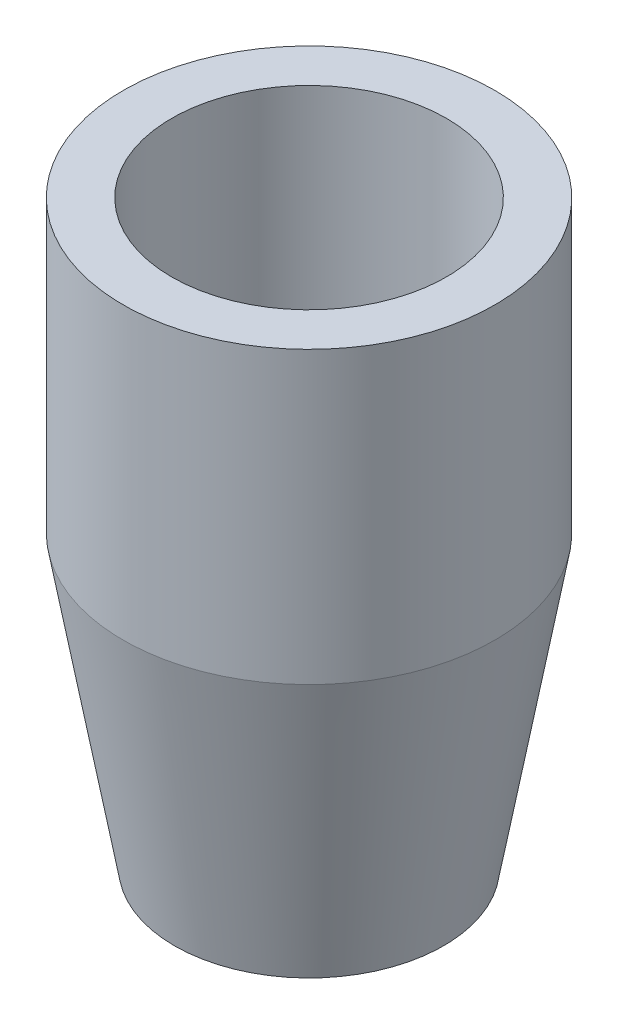
ISO-10303-21;
HEADER;
FILE_DESCRIPTION(('STEP AP214'),'2;1');
FILE_NAME('part.step','',(''),(''),'','','');
FILE_SCHEMA(('AUTOMOTIVE_DESIGN { 1 0 10303 214 1 1 1 1 }'));
ENDSEC;
DATA;
#1=APPLICATION_CONTEXT('core data for automotive mechanical design processes');
#2=APPLICATION_PROTOCOL_DEFINITION('international standard','automotive_design',2000,#1);
#3=PRODUCT_CONTEXT('',#1,'mechanical');
#4=PRODUCT('Part','Part','',(#3));
#5=PRODUCT_RELATED_PRODUCT_CATEGORY('part','',(#4));
#6=PRODUCT_DEFINITION_FORMATION('','',#4);
#7=PRODUCT_DEFINITION_CONTEXT('part definition',#1,'design');
#8=PRODUCT_DEFINITION('design','',#6,#7);
#9=PRODUCT_DEFINITION_SHAPE('','',#8);
#10=(LENGTH_UNIT() NAMED_UNIT(*) SI_UNIT(.MILLI.,.METRE.));
#11=(NAMED_UNIT(*) PLANE_ANGLE_UNIT() SI_UNIT($,.RADIAN.));
#12=(NAMED_UNIT(*) SI_UNIT($,.STERADIAN.) SOLID_ANGLE_UNIT());
#13=UNCERTAINTY_MEASURE_WITH_UNIT(LENGTH_MEASURE(1.E-05),#10,'distance_accuracy_value','');
#14=(GEOMETRIC_REPRESENTATION_CONTEXT(3) GLOBAL_UNCERTAINTY_ASSIGNED_CONTEXT((#13)) GLOBAL_UNIT_ASSIGNED_CONTEXT((#10,
#11,#12)) REPRESENTATION_CONTEXT('',''));
#15=CARTESIAN_POINT('',(0.,0.,0.));
#16=DIRECTION('',(0.,0.,1.));
#17=DIRECTION('',(1.,0.,0.));
#18=AXIS2_PLACEMENT_3D('',#15,#16,#17);
#19=CARTESIAN_POINT('',(-16.2818840700152,0.,0.));
#20=DIRECTION('',(0.,-1.,0.));
#21=DIRECTION('',(0.,0.,-1.));
#22=AXIS2_PLACEMENT_3D('',#19,#20,#21);
#23=CYLINDRICAL_SURFACE('',#22,16.2818840700152);
#24=CARTESIAN_POINT('',(-16.2818840700152,0.,0.));
#25=DIRECTION('',(0.,-1.,0.));
#26=DIRECTION('',(0.,0.,-1.));
#27=AXIS2_PLACEMENT_3D('',#24,#25,#26);
#28=CIRCLE('',#27,16.2818840700152);
#29=CARTESIAN_POINT('',(-16.2818840700152,0.,-16.2818840700152));
#30=VERTEX_POINT('',#29);
#31=EDGE_CURVE('E10',#30,#30,#28,.T.);
#32=ORIENTED_EDGE('',*,*,#31,.T.);
#33=EDGE_LOOP('',(#32));
#34=FACE_BOUND('',#33,.T.);
#35=CARTESIAN_POINT('',(-16.2818840700152,50.8,0.));
#36=DIRECTION('',(0.,-1.,0.));
#37=DIRECTION('',(0.,0.,-1.));
#38=AXIS2_PLACEMENT_3D('',#35,#36,#37);
#39=CIRCLE('',#38,16.2818840700152);
#40=CARTESIAN_POINT('',(-16.2818840700152,50.8,-16.2818840700152));
#41=VERTEX_POINT('',#40);
#42=EDGE_CURVE('E63',#41,#41,#39,.T.);
#43=ORIENTED_EDGE('',*,*,#42,.F.);
#44=EDGE_LOOP('',(#43));
#45=FACE_BOUND('',#44,.T.);
#46=ADVANCED_FACE('F35',(#34,#45),#23,.F.);
#47=CARTESIAN_POINT('',(0.,0.,0.));
#48=DIRECTION('',(0.,-1.,0.));
#49=DIRECTION('',(0.,0.,-1.));
#50=AXIS2_PLACEMENT_3D('',#47,#48,#49);
#51=PLANE('',#50);
#52=CARTESIAN_POINT('',(-16.2818840700152,0.,0.));
#53=DIRECTION('',(0.,-1.,0.));
#54=DIRECTION('',(0.,0.,-1.));
#55=AXIS2_PLACEMENT_3D('',#52,#53,#54);
#56=CIRCLE('',#55,35.3318840700152);
#57=CARTESIAN_POINT('',(-16.2818840700152,0.,-35.3318840700152));
#58=VERTEX_POINT('',#57);
#59=EDGE_CURVE('E41',#58,#58,#56,.T.);
#60=ORIENTED_EDGE('',*,*,#59,.T.);
#61=EDGE_LOOP('',(#60));
#62=FACE_BOUND('',#61,.T.);
#63=ORIENTED_EDGE('',*,*,#31,.F.);
#64=EDGE_LOOP('',(#63));
#65=FACE_BOUND('',#64,.T.);
#66=ADVANCED_FACE('F71',(#62,#65),#51,.T.);
#67=CARTESIAN_POINT('',(-16.2818840700152,0.,0.));
#68=DIRECTION('',(0.,1.,0.));
#69=DIRECTION('',(0.,0.,1.));
#70=AXIS2_PLACEMENT_3D('',#67,#68,#69);
#71=CONICAL_SURFACE('',#70,35.3318840700152,0.17453292519943);
#72=CARTESIAN_POINT('',(-16.2818840700152,76.2,0.));
#73=DIRECTION('',(0.,-1.,0.));
#74=DIRECTION('',(0.,0.,-1.));
#75=AXIS2_PLACEMENT_3D('',#72,#73,#74);
#76=CIRCLE('',#75,48.768);
#77=CARTESIAN_POINT('',(-16.2818840700152,76.2,-48.768));
#78=VERTEX_POINT('',#77);
#79=EDGE_CURVE('E45',#78,#78,#76,.T.);
#80=ORIENTED_EDGE('',*,*,#79,.T.);
#81=EDGE_LOOP('',(#80));
#82=FACE_BOUND('',#81,.T.);
#83=ORIENTED_EDGE('',*,*,#59,.F.);
#84=EDGE_LOOP('',(#83));
#85=FACE_BOUND('',#84,.T.);
#86=ADVANCED_FACE('F75',(#82,#85),#71,.T.);
#87=CARTESIAN_POINT('',(-16.2818840700152,0.,0.));
#88=DIRECTION('',(0.,-1.,0.));
#89=DIRECTION('',(0.,0.,-1.));
#90=AXIS2_PLACEMENT_3D('',#87,#88,#89);
#91=CYLINDRICAL_SURFACE('',#90,48.768);
#92=CARTESIAN_POINT('',(-16.2818840700152,152.4,0.));
#93=DIRECTION('',(0.,-1.,0.));
#94=DIRECTION('',(0.,0.,-1.));
#95=AXIS2_PLACEMENT_3D('',#92,#93,#94);
#96=CIRCLE('',#95,48.768);
#97=CARTESIAN_POINT('',(-16.2818840700152,152.4,-48.768));
#98=VERTEX_POINT('',#97);
#99=EDGE_CURVE('E49',#98,#98,#96,.T.);
#100=ORIENTED_EDGE('',*,*,#99,.T.);
#101=EDGE_LOOP('',(#100));
#102=FACE_BOUND('',#101,.T.);
#103=ORIENTED_EDGE('',*,*,#79,.F.);
#104=EDGE_LOOP('',(#103));
#105=FACE_BOUND('',#104,.T.);
#106=ADVANCED_FACE('F79',(#102,#105),#91,.T.);
#107=CARTESIAN_POINT('',(32.4861159299848,152.4,0.));
#108=DIRECTION('',(0.,1.,0.));
#109=DIRECTION('',(0.,0.,1.));
#110=AXIS2_PLACEMENT_3D('',#107,#108,#109);
#111=PLANE('',#110);
#112=CARTESIAN_POINT('',(-16.2818840700152,152.4,0.));
#113=DIRECTION('',(0.,-1.,0.));
#114=DIRECTION('',(0.,0.,-1.));
#115=AXIS2_PLACEMENT_3D('',#112,#113,#114);
#116=CIRCLE('',#115,36.068);
#117=CARTESIAN_POINT('',(-16.2818840700152,152.4,-36.068));
#118=VERTEX_POINT('',#117);
#119=EDGE_CURVE('E54',#118,#118,#116,.T.);
#120=ORIENTED_EDGE('',*,*,#119,.T.);
#121=EDGE_LOOP('',(#120));
#122=FACE_BOUND('',#121,.T.);
#123=ORIENTED_EDGE('',*,*,#99,.F.);
#124=EDGE_LOOP('',(#123));
#125=FACE_BOUND('',#124,.T.);
#126=ADVANCED_FACE('F86',(#122,#125),#111,.T.);
#127=CARTESIAN_POINT('',(-16.2818840700152,0.,0.));
#128=DIRECTION('',(0.,-1.,0.));
#129=DIRECTION('',(0.,0.,-1.));
#130=AXIS2_PLACEMENT_3D('',#127,#128,#129);
#131=CYLINDRICAL_SURFACE('',#130,36.068);
#132=CARTESIAN_POINT('',(-16.2818840700152,76.2,0.));
#133=DIRECTION('',(0.,-1.,0.));
#134=DIRECTION('',(0.,0.,-1.));
#135=AXIS2_PLACEMENT_3D('',#132,#133,#134);
#136=CIRCLE('',#135,36.068);
#137=CARTESIAN_POINT('',(-16.2818840700152,76.2,-36.068));
#138=VERTEX_POINT('',#137);
#139=EDGE_CURVE('E57',#138,#138,#136,.T.);
#140=ORIENTED_EDGE('',*,*,#139,.T.);
#141=EDGE_LOOP('',(#140));
#142=FACE_BOUND('',#141,.T.);
#143=ORIENTED_EDGE('',*,*,#119,.F.);
#144=EDGE_LOOP('',(#143));
#145=FACE_BOUND('',#144,.T.);
#146=ADVANCED_FACE('F90',(#142,#145),#131,.F.);
#147=CARTESIAN_POINT('',(19.7861159299848,76.2,0.));
#148=DIRECTION('',(0.,1.,0.));
#149=DIRECTION('',(0.,0.,1.));
#150=AXIS2_PLACEMENT_3D('',#147,#148,#149);
#151=PLANE('',#150);
#152=CARTESIAN_POINT('',(-16.2818840700152,76.2,0.));
#153=DIRECTION('',(0.,-1.,0.));
#154=DIRECTION('',(0.,0.,-1.));
#155=AXIS2_PLACEMENT_3D('',#152,#153,#154);
#156=CIRCLE('',#155,29.718);
#157=CARTESIAN_POINT('',(-16.2818840700152,76.2,-29.718));
#158=VERTEX_POINT('',#157);
#159=EDGE_CURVE('E60',#158,#158,#156,.T.);
#160=ORIENTED_EDGE('',*,*,#159,.T.);
#161=EDGE_LOOP('',(#160));
#162=FACE_BOUND('',#161,.T.);
#163=ORIENTED_EDGE('',*,*,#139,.F.);
#164=EDGE_LOOP('',(#163));
#165=FACE_BOUND('',#164,.T.);
#166=ADVANCED_FACE('F94',(#162,#165),#151,.T.);
#167=CARTESIAN_POINT('',(-16.2818840700152,76.2,0.));
#168=DIRECTION('',(0.,1.,0.));
#169=DIRECTION('',(0.,0.,1.));
#170=AXIS2_PLACEMENT_3D('',#167,#168,#169);
#171=CONICAL_SURFACE('',#170,29.718,0.486562664497257);
#172=ORIENTED_EDGE('',*,*,#42,.T.);
#173=EDGE_LOOP('',(#172));
#174=FACE_BOUND('',#173,.T.);
#175=ORIENTED_EDGE('',*,*,#159,.F.);
#176=EDGE_LOOP('',(#175));
#177=FACE_BOUND('',#176,.T.);
#178=ADVANCED_FACE('F67',(#174,#177),#171,.F.);
#179=CLOSED_SHELL('',(#46,#66,#86,#106,#126,#146,#166,#178));
#180=MANIFOLD_SOLID_BREP('B2',#179);
#181=ADVANCED_BREP_SHAPE_REPRESENTATION('',(#18,#180),#14);
#182=SHAPE_DEFINITION_REPRESENTATION(#9,#181);
ENDSEC;
END-ISO-10303-21;
